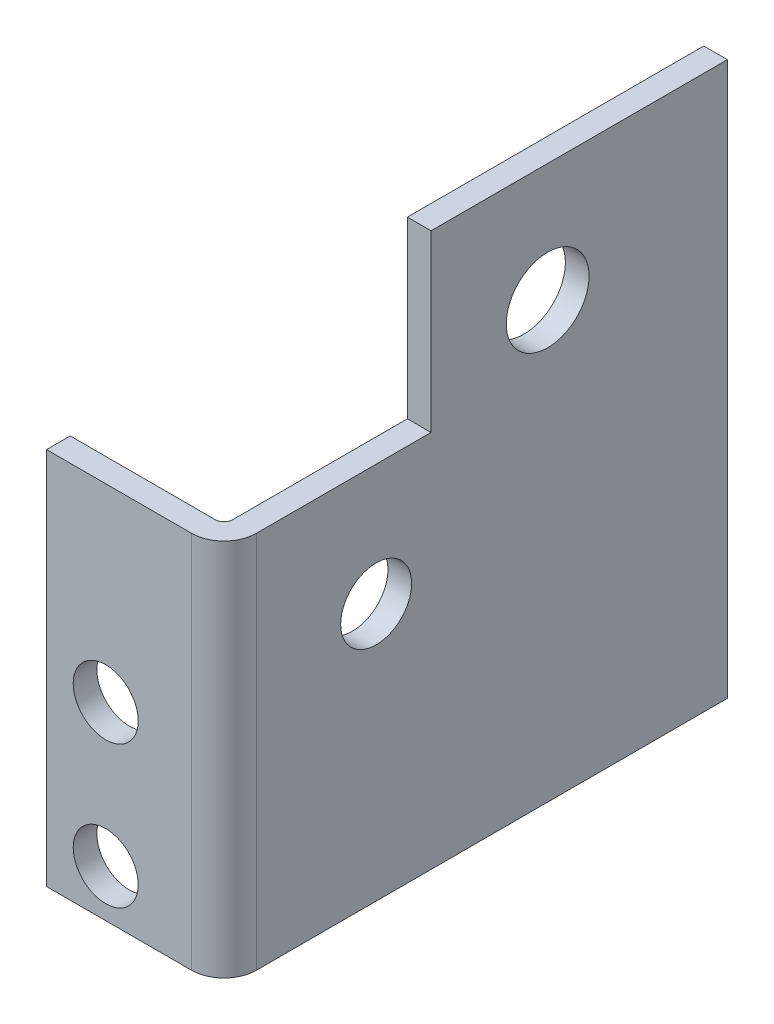
ISO-10303-21;
HEADER;
FILE_DESCRIPTION(('STEP AP214'),'2;1');
FILE_NAME('part.step','',(''),(''),'','','');
FILE_SCHEMA(('AUTOMOTIVE_DESIGN { 1 0 10303 214 1 1 1 1 }'));
ENDSEC;
DATA;
#1=APPLICATION_CONTEXT('core data for automotive mechanical design processes');
#2=APPLICATION_PROTOCOL_DEFINITION('international standard','automotive_design',2000,#1);
#3=PRODUCT_CONTEXT('',#1,'mechanical');
#4=PRODUCT('Part','Part','',(#3));
#5=PRODUCT_RELATED_PRODUCT_CATEGORY('part','',(#4));
#6=PRODUCT_DEFINITION_FORMATION('','',#4);
#7=PRODUCT_DEFINITION_CONTEXT('part definition',#1,'design');
#8=PRODUCT_DEFINITION('design','',#6,#7);
#9=PRODUCT_DEFINITION_SHAPE('','',#8);
#10=(LENGTH_UNIT() NAMED_UNIT(*) SI_UNIT(.MILLI.,.METRE.));
#11=(NAMED_UNIT(*) PLANE_ANGLE_UNIT() SI_UNIT($,.RADIAN.));
#12=(NAMED_UNIT(*) SI_UNIT($,.STERADIAN.) SOLID_ANGLE_UNIT());
#13=UNCERTAINTY_MEASURE_WITH_UNIT(LENGTH_MEASURE(1.E-05),#10,'distance_accuracy_value','');
#14=(GEOMETRIC_REPRESENTATION_CONTEXT(3) GLOBAL_UNCERTAINTY_ASSIGNED_CONTEXT((#13)) GLOBAL_UNIT_ASSIGNED_CONTEXT((#10,
#11,#12)) REPRESENTATION_CONTEXT('',''));
#15=CARTESIAN_POINT('',(0.,0.,0.));
#16=DIRECTION('',(0.,0.,1.));
#17=DIRECTION('',(1.,0.,0.));
#18=AXIS2_PLACEMENT_3D('',#15,#16,#17);
#19=CARTESIAN_POINT('',(2.,0.,-35.2));
#20=DIRECTION('',(-1.,0.,0.));
#21=DIRECTION('',(0.,0.,-1.));
#22=AXIS2_PLACEMENT_3D('',#19,#20,#21);
#23=PLANE('',#22);
#24=CARTESIAN_POINT('',(2.,25.,-5.4966));
#25=DIRECTION('',(-1.,0.,0.));
#26=DIRECTION('',(0.,0.,1.));
#27=AXIS2_PLACEMENT_3D('',#24,#25,#26);
#28=CIRCLE('',#27,3.);
#29=CARTESIAN_POINT('',(2.,25.,-2.4966));
#30=VERTEX_POINT('',#29);
#31=EDGE_CURVE('E140',#30,#30,#28,.T.);
#32=ORIENTED_EDGE('',*,*,#31,.T.);
#33=EDGE_LOOP('',(#32));
#34=FACE_BOUND('',#33,.T.);
#35=CARTESIAN_POINT('',(2.,40.,-20.));
#36=DIRECTION('',(1.,0.,0.));
#37=DIRECTION('',(0.,0.,-1.));
#38=AXIS2_PLACEMENT_3D('',#35,#36,#37);
#39=CIRCLE('',#38,3.5);
#40=CARTESIAN_POINT('',(2.,40.,-23.5));
#41=VERTEX_POINT('',#40);
#42=EDGE_CURVE('E198',#41,#41,#39,.T.);
#43=ORIENTED_EDGE('',*,*,#42,.F.);
#44=EDGE_LOOP('',(#43));
#45=FACE_BOUND('',#44,.T.);
#46=DIRECTION('',(0.,-1.,0.));
#47=VECTOR('',#46,1.);
#48=CARTESIAN_POINT('',(2.,3.23,4.6334));
#49=LINE('',#48,#47);
#50=CARTESIAN_POINT('',(2.,3.23,4.6334));
#51=VERTEX_POINT('',#50);
#52=CARTESIAN_POINT('',(2.,35.23,4.6334));
#53=VERTEX_POINT('',#52);
#54=EDGE_CURVE('E178',#51,#53,#49,.F.);
#55=ORIENTED_EDGE('',*,*,#54,.F.);
#56=DIRECTION('',(0.,0.,-1.));
#57=VECTOR('',#56,1.);
#58=CARTESIAN_POINT('',(2.,3.23,-35.2));
#59=LINE('',#58,#57);
#60=CARTESIAN_POINT('',(2.,3.23,-35.2));
#61=VERTEX_POINT('',#60);
#62=EDGE_CURVE('E206',#51,#61,#59,.T.);
#63=ORIENTED_EDGE('',*,*,#62,.T.);
#64=DIRECTION('',(0.,1.,0.));
#65=VECTOR('',#64,1.);
#66=CARTESIAN_POINT('',(2.,0.,-35.2));
#67=LINE('',#66,#65);
#68=CARTESIAN_POINT('',(2.,50.,-35.2));
#69=VERTEX_POINT('',#68);
#70=EDGE_CURVE('E209',#61,#69,#67,.T.);
#71=ORIENTED_EDGE('',*,*,#70,.T.);
#72=DIRECTION('',(0.,0.,1.));
#73=VECTOR('',#72,1.);
#74=CARTESIAN_POINT('',(2.,50.,-35.2));
#75=LINE('',#74,#73);
#76=CARTESIAN_POINT('',(2.,50.,-10.14));
#77=VERTEX_POINT('',#76);
#78=EDGE_CURVE('E11',#69,#77,#75,.T.);
#79=ORIENTED_EDGE('',*,*,#78,.T.);
#80=DIRECTION('',(0.,1.,0.));
#81=VECTOR('',#80,1.);
#82=CARTESIAN_POINT('',(2.,0.,-10.14));
#83=LINE('',#82,#81);
#84=CARTESIAN_POINT('',(2.,35.23,-10.14));
#85=VERTEX_POINT('',#84);
#86=EDGE_CURVE('E192',#85,#77,#83,.T.);
#87=ORIENTED_EDGE('',*,*,#86,.F.);
#88=DIRECTION('',(0.,0.,-1.));
#89=VECTOR('',#88,1.);
#90=CARTESIAN_POINT('',(2.,35.23,-15.1));
#91=LINE('',#90,#89);
#92=EDGE_CURVE('E149',#53,#85,#91,.T.);
#93=ORIENTED_EDGE('',*,*,#92,.F.);
#94=EDGE_LOOP('',(#55,#63,#71,#79,#87,#93));
#95=FACE_BOUND('',#94,.T.);
#96=ADVANCED_FACE('F37',(#34,#45,#95),#23,.F.);
#97=CARTESIAN_POINT('',(0.,0.,-35.2));
#98=DIRECTION('',(-1.,0.,0.));
#99=DIRECTION('',(0.,0.,-1.));
#100=AXIS2_PLACEMENT_3D('',#97,#98,#99);
#101=PLANE('',#100);
#102=CARTESIAN_POINT('',(0.,25.,-5.4966));
#103=DIRECTION('',(-1.,0.,0.));
#104=DIRECTION('',(0.,0.,1.));
#105=AXIS2_PLACEMENT_3D('',#102,#103,#104);
#106=CIRCLE('',#105,3.);
#107=CARTESIAN_POINT('',(0.,25.,-2.4966));
#108=VERTEX_POINT('',#107);
#109=EDGE_CURVE('E143',#108,#108,#106,.T.);
#110=ORIENTED_EDGE('',*,*,#109,.F.);
#111=EDGE_LOOP('',(#110));
#112=FACE_BOUND('',#111,.T.);
#113=CARTESIAN_POINT('',(0.,40.,-20.));
#114=DIRECTION('',(1.,0.,0.));
#115=DIRECTION('',(0.,0.,-1.));
#116=AXIS2_PLACEMENT_3D('',#113,#114,#115);
#117=CIRCLE('',#116,3.5);
#118=CARTESIAN_POINT('',(0.,40.,-23.5));
#119=VERTEX_POINT('',#118);
#120=EDGE_CURVE('E195',#119,#119,#117,.T.);
#121=ORIENTED_EDGE('',*,*,#120,.T.);
#122=EDGE_LOOP('',(#121));
#123=FACE_BOUND('',#122,.T.);
#124=DIRECTION('',(0.,-1.,0.));
#125=VECTOR('',#124,1.);
#126=CARTESIAN_POINT('',(0.,3.23,4.6334));
#127=LINE('',#126,#125);
#128=CARTESIAN_POINT('',(0.,3.23,4.6334));
#129=VERTEX_POINT('',#128);
#130=CARTESIAN_POINT('',(0.,35.23,4.6334));
#131=VERTEX_POINT('',#130);
#132=EDGE_CURVE('E183',#129,#131,#127,.F.);
#133=ORIENTED_EDGE('',*,*,#132,.T.);
#134=DIRECTION('',(0.,0.,1.));
#135=VECTOR('',#134,1.);
#136=CARTESIAN_POINT('',(0.,35.23,-15.1));
#137=LINE('',#136,#135);
#138=CARTESIAN_POINT('',(0.,35.23,-10.14));
#139=VERTEX_POINT('',#138);
#140=EDGE_CURVE('E139',#139,#131,#137,.T.);
#141=ORIENTED_EDGE('',*,*,#140,.F.);
#142=DIRECTION('',(0.,1.,0.));
#143=VECTOR('',#142,1.);
#144=CARTESIAN_POINT('',(0.,35.23,-10.14));
#145=LINE('',#144,#143);
#146=CARTESIAN_POINT('',(0.,50.,-10.14));
#147=VERTEX_POINT('',#146);
#148=EDGE_CURVE('E187',#139,#147,#145,.T.);
#149=ORIENTED_EDGE('',*,*,#148,.T.);
#150=DIRECTION('',(0.,0.,1.));
#151=VECTOR('',#150,1.);
#152=CARTESIAN_POINT('',(0.,50.,-35.2));
#153=LINE('',#152,#151);
#154=CARTESIAN_POINT('',(0.,50.,-35.2));
#155=VERTEX_POINT('',#154);
#156=EDGE_CURVE('E44',#155,#147,#153,.T.);
#157=ORIENTED_EDGE('',*,*,#156,.F.);
#158=DIRECTION('',(0.,1.,0.));
#159=VECTOR('',#158,1.);
#160=CARTESIAN_POINT('',(0.,0.,-35.2));
#161=LINE('',#160,#159);
#162=CARTESIAN_POINT('',(0.,3.23,-35.2));
#163=VERTEX_POINT('',#162);
#164=EDGE_CURVE('E214',#163,#155,#161,.T.);
#165=ORIENTED_EDGE('',*,*,#164,.F.);
#166=DIRECTION('',(0.,0.,1.));
#167=VECTOR('',#166,1.);
#168=CARTESIAN_POINT('',(0.,3.23,-35.2));
#169=LINE('',#168,#167);
#170=EDGE_CURVE('E201',#163,#129,#169,.T.);
#171=ORIENTED_EDGE('',*,*,#170,.T.);
#172=EDGE_LOOP('',(#133,#141,#149,#157,#165,#171));
#173=FACE_BOUND('',#172,.T.);
#174=ADVANCED_FACE('F223',(#112,#123,#173),#101,.T.);
#175=CARTESIAN_POINT('',(0.,3.23,0.));
#176=DIRECTION('',(0.,-1.,0.));
#177=DIRECTION('',(0.,0.,1.));
#178=AXIS2_PLACEMENT_3D('',#175,#176,#177);
#179=PLANE('',#178);
#180=ORIENTED_EDGE('',*,*,#170,.F.);
#181=DIRECTION('',(-1.,0.,0.));
#182=VECTOR('',#181,1.);
#183=CARTESIAN_POINT('',(0.,3.23,-35.2));
#184=LINE('',#183,#182);
#185=EDGE_CURVE('E204',#61,#163,#184,.T.);
#186=ORIENTED_EDGE('',*,*,#185,.F.);
#187=ORIENTED_EDGE('',*,*,#62,.F.);
#188=DIRECTION('',(1.,0.,0.));
#189=VECTOR('',#188,1.);
#190=CARTESIAN_POINT('',(0.,3.23,4.6334));
#191=LINE('',#190,#189);
#192=EDGE_CURVE('E180',#129,#51,#191,.T.);
#193=ORIENTED_EDGE('',*,*,#192,.F.);
#194=EDGE_LOOP('',(#180,#186,#187,#193));
#195=FACE_BOUND('',#194,.T.);
#196=ADVANCED_FACE('F237',(#195),#179,.T.);
#197=CARTESIAN_POINT('',(0.,0.,-35.2));
#198=DIRECTION('',(0.,0.,1.));
#199=DIRECTION('',(-1.,0.,0.));
#200=AXIS2_PLACEMENT_3D('',#197,#198,#199);
#201=PLANE('',#200);
#202=ORIENTED_EDGE('',*,*,#185,.T.);
#203=ORIENTED_EDGE('',*,*,#164,.T.);
#204=DIRECTION('',(1.,0.,0.));
#205=VECTOR('',#204,1.);
#206=CARTESIAN_POINT('',(0.,50.,-35.2));
#207=LINE('',#206,#205);
#208=EDGE_CURVE('E212',#155,#69,#207,.T.);
#209=ORIENTED_EDGE('',*,*,#208,.T.);
#210=ORIENTED_EDGE('',*,*,#70,.F.);
#211=EDGE_LOOP('',(#202,#203,#209,#210));
#212=FACE_BOUND('',#211,.T.);
#213=ADVANCED_FACE('F234',(#212),#201,.F.);
#214=CARTESIAN_POINT('',(0.,50.,-35.2));
#215=DIRECTION('',(0.,1.,0.));
#216=DIRECTION('',(0.,0.,-1.));
#217=AXIS2_PLACEMENT_3D('',#214,#215,#216);
#218=PLANE('',#217);
#219=DIRECTION('',(-1.,0.,0.));
#220=VECTOR('',#219,1.);
#221=CARTESIAN_POINT('',(8.,50.,-10.14));
#222=LINE('',#221,#220);
#223=EDGE_CURVE('E190',#77,#147,#222,.T.);
#224=ORIENTED_EDGE('',*,*,#223,.F.);
#225=ORIENTED_EDGE('',*,*,#78,.F.);
#226=ORIENTED_EDGE('',*,*,#208,.F.);
#227=ORIENTED_EDGE('',*,*,#156,.T.);
#228=EDGE_LOOP('',(#224,#225,#226,#227));
#229=FACE_BOUND('',#228,.T.);
#230=ADVANCED_FACE('F219',(#229),#218,.T.);
#231=CARTESIAN_POINT('',(10.,40.,-20.));
#232=DIRECTION('',(-1.,0.,0.));
#233=DIRECTION('',(0.,0.,-1.));
#234=AXIS2_PLACEMENT_3D('',#231,#232,#233);
#235=CYLINDRICAL_SURFACE('',#234,3.5);
#236=ORIENTED_EDGE('',*,*,#120,.F.);
#237=EDGE_LOOP('',(#236));
#238=FACE_BOUND('',#237,.T.);
#239=ORIENTED_EDGE('',*,*,#42,.T.);
#240=EDGE_LOOP('',(#239));
#241=FACE_BOUND('',#240,.T.);
#242=ADVANCED_FACE('F264',(#238,#241),#235,.F.);
#243=CARTESIAN_POINT('',(8.,35.23,-10.14));
#244=DIRECTION('',(0.,0.,-1.));
#245=DIRECTION('',(1.,0.,0.));
#246=AXIS2_PLACEMENT_3D('',#243,#244,#245);
#247=PLANE('',#246);
#248=DIRECTION('',(-1.,0.,0.));
#249=VECTOR('',#248,1.);
#250=CARTESIAN_POINT('',(8.,35.23,-10.14));
#251=LINE('',#250,#249);
#252=EDGE_CURVE('E59',#85,#139,#251,.T.);
#253=ORIENTED_EDGE('',*,*,#252,.F.);
#254=ORIENTED_EDGE('',*,*,#86,.T.);
#255=ORIENTED_EDGE('',*,*,#223,.T.);
#256=ORIENTED_EDGE('',*,*,#148,.F.);
#257=EDGE_LOOP('',(#253,#254,#255,#256));
#258=FACE_BOUND('',#257,.T.);
#259=ADVANCED_FACE('F224',(#258),#247,.F.);
#260=CARTESIAN_POINT('',(-0.736599999999997,3.23,4.6334));
#261=DIRECTION('',(0.,1.,0.));
#262=DIRECTION('',(0.,0.,-1.));
#263=AXIS2_PLACEMENT_3D('',#260,#261,#262);
#264=PLANE('',#263);
#265=CARTESIAN_POINT('',(-0.736599999999997,3.23,4.6334));
#266=DIRECTION('',(0.,1.,0.));
#267=DIRECTION('',(0.,0.,1.));
#268=AXIS2_PLACEMENT_3D('',#265,#266,#267);
#269=CIRCLE('',#268,0.7366);
#270=CARTESIAN_POINT('',(-0.736599999999994,3.23,5.37));
#271=VERTEX_POINT('',#270);
#272=EDGE_CURVE('E51',#271,#129,#269,.T.);
#273=ORIENTED_EDGE('',*,*,#272,.T.);
#274=ORIENTED_EDGE('',*,*,#192,.T.);
#275=CARTESIAN_POINT('',(-0.736599999999997,3.23,4.6334));
#276=DIRECTION('',(0.,1.,0.));
#277=DIRECTION('',(0.,0.,1.));
#278=AXIS2_PLACEMENT_3D('',#275,#276,#277);
#279=CIRCLE('',#278,2.7366);
#280=CARTESIAN_POINT('',(-0.736599999999997,3.23,7.37));
#281=VERTEX_POINT('',#280);
#282=EDGE_CURVE('E181',#281,#51,#279,.T.);
#283=ORIENTED_EDGE('',*,*,#282,.F.);
#284=DIRECTION('',(0.,0.,1.));
#285=VECTOR('',#284,1.);
#286=CARTESIAN_POINT('',(-0.736599999999997,3.23,5.37));
#287=LINE('',#286,#285);
#288=EDGE_CURVE('E125',#271,#281,#287,.T.);
#289=ORIENTED_EDGE('',*,*,#288,.F.);
#290=EDGE_LOOP('',(#273,#274,#283,#289));
#291=FACE_BOUND('',#290,.T.);
#292=ADVANCED_FACE('F239',(#291),#264,.F.);
#293=CARTESIAN_POINT('',(-0.736599999999997,3.23,4.6334));
#294=DIRECTION('',(0.,-1.,0.));
#295=DIRECTION('',(0.,0.,1.));
#296=AXIS2_PLACEMENT_3D('',#293,#294,#295);
#297=CYLINDRICAL_SURFACE('',#296,2.7366);
#298=ORIENTED_EDGE('',*,*,#54,.T.);
#299=CARTESIAN_POINT('',(-0.736599999999997,35.23,4.6334));
#300=DIRECTION('',(0.,1.,0.));
#301=DIRECTION('',(0.,0.,1.));
#302=AXIS2_PLACEMENT_3D('',#299,#300,#301);
#303=CIRCLE('',#302,2.7366);
#304=CARTESIAN_POINT('',(-0.736599999999997,35.23,7.37));
#305=VERTEX_POINT('',#304);
#306=EDGE_CURVE('E152',#305,#53,#303,.T.);
#307=ORIENTED_EDGE('',*,*,#306,.F.);
#308=DIRECTION('',(0.,-1.,0.));
#309=VECTOR('',#308,1.);
#310=CARTESIAN_POINT('',(-0.736599999999997,0.,7.37));
#311=LINE('',#310,#309);
#312=EDGE_CURVE('E173',#305,#281,#311,.T.);
#313=ORIENTED_EDGE('',*,*,#312,.T.);
#314=ORIENTED_EDGE('',*,*,#282,.T.);
#315=EDGE_LOOP('',(#298,#307,#313,#314));
#316=FACE_BOUND('',#315,.T.);
#317=ADVANCED_FACE('F241',(#316),#297,.T.);
#318=CARTESIAN_POINT('',(-0.736599999999997,3.23,4.6334));
#319=DIRECTION('',(0.,-1.,0.));
#320=DIRECTION('',(0.,0.,1.));
#321=AXIS2_PLACEMENT_3D('',#318,#319,#320);
#322=CYLINDRICAL_SURFACE('',#321,0.7366);
#323=ORIENTED_EDGE('',*,*,#132,.F.);
#324=ORIENTED_EDGE('',*,*,#272,.F.);
#325=DIRECTION('',(0.,1.,0.));
#326=VECTOR('',#325,1.);
#327=CARTESIAN_POINT('',(-0.736599999999997,23.23,5.37));
#328=LINE('',#327,#326);
#329=CARTESIAN_POINT('',(-0.736599999999997,35.23,5.37000000000004));
#330=VERTEX_POINT('',#329);
#331=EDGE_CURVE('E116',#330,#271,#328,.F.);
#332=ORIENTED_EDGE('',*,*,#331,.F.);
#333=CARTESIAN_POINT('',(-0.736599999999997,35.23,4.6334));
#334=DIRECTION('',(0.,1.,0.));
#335=DIRECTION('',(0.,0.,1.));
#336=AXIS2_PLACEMENT_3D('',#333,#334,#335);
#337=CIRCLE('',#336,0.73660000000002);
#338=EDGE_CURVE('E121',#131,#330,#337,.F.);
#339=ORIENTED_EDGE('',*,*,#338,.F.);
#340=EDGE_LOOP('',(#323,#324,#332,#339));
#341=FACE_BOUND('',#340,.T.);
#342=ADVANCED_FACE('F119',(#341),#322,.F.);
#343=CARTESIAN_POINT('',(0.,3.23,7.37));
#344=DIRECTION('',(0.,-1.,0.));
#345=DIRECTION('',(0.,0.,1.));
#346=AXIS2_PLACEMENT_3D('',#343,#344,#345);
#347=PLANE('',#346);
#348=DIRECTION('',(1.,0.,0.));
#349=VECTOR('',#348,1.);
#350=CARTESIAN_POINT('',(0.,3.23,7.37));
#351=LINE('',#350,#349);
#352=CARTESIAN_POINT('',(-13.,3.23,7.37000000000004));
#353=VERTEX_POINT('',#352);
#354=EDGE_CURVE('E166',#353,#281,#351,.T.);
#355=ORIENTED_EDGE('',*,*,#354,.F.);
#356=DIRECTION('',(0.,0.,-1.));
#357=VECTOR('',#356,1.);
#358=CARTESIAN_POINT('',(-13.,3.23,7.37000000000004));
#359=LINE('',#358,#357);
#360=CARTESIAN_POINT('',(-13.,3.23,5.37000000000004));
#361=VERTEX_POINT('',#360);
#362=EDGE_CURVE('E163',#353,#361,#359,.T.);
#363=ORIENTED_EDGE('',*,*,#362,.T.);
#364=DIRECTION('',(-1.,0.,0.));
#365=VECTOR('',#364,1.);
#366=CARTESIAN_POINT('',(0.,3.23,5.37));
#367=LINE('',#366,#365);
#368=EDGE_CURVE('E170',#361,#271,#367,.F.);
#369=ORIENTED_EDGE('',*,*,#368,.T.);
#370=ORIENTED_EDGE('',*,*,#288,.T.);
#371=EDGE_LOOP('',(#355,#363,#369,#370));
#372=FACE_BOUND('',#371,.T.);
#373=ADVANCED_FACE('F246',(#372),#347,.T.);
#374=CARTESIAN_POINT('',(0.,0.,7.37));
#375=DIRECTION('',(0.,0.,1.));
#376=DIRECTION('',(-1.,0.,0.));
#377=AXIS2_PLACEMENT_3D('',#374,#375,#376);
#378=PLANE('',#377);
#379=CARTESIAN_POINT('',(-8.00000000000001,7.23,7.37000000000003));
#380=DIRECTION('',(0.,0.,-1.));
#381=DIRECTION('',(-1.,0.,0.));
#382=AXIS2_PLACEMENT_3D('',#379,#380,#381);
#383=CIRCLE('',#382,2.75);
#384=CARTESIAN_POINT('',(-10.75,7.23,7.37000000000004));
#385=VERTEX_POINT('',#384);
#386=EDGE_CURVE('E155',#385,#385,#383,.T.);
#387=ORIENTED_EDGE('',*,*,#386,.T.);
#388=EDGE_LOOP('',(#387));
#389=FACE_BOUND('',#388,.T.);
#390=CARTESIAN_POINT('',(-8.00000000000001,19.23,7.37000000000003));
#391=DIRECTION('',(0.,0.,-1.));
#392=DIRECTION('',(-1.,0.,0.));
#393=AXIS2_PLACEMENT_3D('',#390,#391,#392);
#394=CIRCLE('',#393,2.75);
#395=CARTESIAN_POINT('',(-10.75,19.23,7.37000000000004));
#396=VERTEX_POINT('',#395);
#397=EDGE_CURVE('E126',#396,#396,#394,.T.);
#398=ORIENTED_EDGE('',*,*,#397,.T.);
#399=EDGE_LOOP('',(#398));
#400=FACE_BOUND('',#399,.T.);
#401=ORIENTED_EDGE('',*,*,#312,.F.);
#402=DIRECTION('',(1.,0.,0.));
#403=VECTOR('',#402,1.);
#404=CARTESIAN_POINT('',(-13.,35.23,7.37));
#405=LINE('',#404,#403);
#406=CARTESIAN_POINT('',(-13.,35.23,7.37));
#407=VERTEX_POINT('',#406);
#408=EDGE_CURVE('E250',#407,#305,#405,.T.);
#409=ORIENTED_EDGE('',*,*,#408,.F.);
#410=DIRECTION('',(0.,-1.,0.));
#411=VECTOR('',#410,1.);
#412=CARTESIAN_POINT('',(-13.,3.23,7.37000000000004));
#413=LINE('',#412,#411);
#414=EDGE_CURVE('E168',#407,#353,#413,.T.);
#415=ORIENTED_EDGE('',*,*,#414,.T.);
#416=ORIENTED_EDGE('',*,*,#354,.T.);
#417=EDGE_LOOP('',(#401,#409,#415,#416));
#418=FACE_BOUND('',#417,.T.);
#419=ADVANCED_FACE('F291',(#389,#400,#418),#378,.T.);
#420=CARTESIAN_POINT('',(0.,0.,5.37));
#421=DIRECTION('',(0.,0.,1.));
#422=DIRECTION('',(-1.,0.,0.));
#423=AXIS2_PLACEMENT_3D('',#420,#421,#422);
#424=PLANE('',#423);
#425=CARTESIAN_POINT('',(-8.00000000000001,7.23,5.37));
#426=DIRECTION('',(0.,0.,1.));
#427=DIRECTION('',(1.,0.,0.));
#428=AXIS2_PLACEMENT_3D('',#425,#426,#427);
#429=CIRCLE('',#428,2.75);
#430=CARTESIAN_POINT('',(-5.25000000000001,7.23,5.37));
#431=VERTEX_POINT('',#430);
#432=EDGE_CURVE('E148',#431,#431,#429,.T.);
#433=ORIENTED_EDGE('',*,*,#432,.T.);
#434=EDGE_LOOP('',(#433));
#435=FACE_BOUND('',#434,.T.);
#436=CARTESIAN_POINT('',(-8.00000000000001,19.23,5.37));
#437=DIRECTION('',(0.,0.,1.));
#438=DIRECTION('',(1.,0.,0.));
#439=AXIS2_PLACEMENT_3D('',#436,#437,#438);
#440=CIRCLE('',#439,2.75);
#441=CARTESIAN_POINT('',(-5.25000000000001,19.23,5.37));
#442=VERTEX_POINT('',#441);
#443=EDGE_CURVE('E158',#442,#442,#440,.T.);
#444=ORIENTED_EDGE('',*,*,#443,.T.);
#445=EDGE_LOOP('',(#444));
#446=FACE_BOUND('',#445,.T.);
#447=ORIENTED_EDGE('',*,*,#331,.T.);
#448=ORIENTED_EDGE('',*,*,#368,.F.);
#449=DIRECTION('',(0.,1.,0.));
#450=VECTOR('',#449,1.);
#451=CARTESIAN_POINT('',(-13.,0.,5.37000000000004));
#452=LINE('',#451,#450);
#453=CARTESIAN_POINT('',(-13.,35.23,5.37000000000004));
#454=VERTEX_POINT('',#453);
#455=EDGE_CURVE('E131',#454,#361,#452,.F.);
#456=ORIENTED_EDGE('',*,*,#455,.F.);
#457=DIRECTION('',(-1.,0.,0.));
#458=VECTOR('',#457,1.);
#459=CARTESIAN_POINT('',(-13.,35.23,5.37000000000004));
#460=LINE('',#459,#458);
#461=EDGE_CURVE('E129',#330,#454,#460,.T.);
#462=ORIENTED_EDGE('',*,*,#461,.F.);
#463=EDGE_LOOP('',(#447,#448,#456,#462));
#464=FACE_BOUND('',#463,.T.);
#465=ADVANCED_FACE('F130',(#435,#446,#464),#424,.F.);
#466=CARTESIAN_POINT('',(-13.,3.23,7.37000000000004));
#467=DIRECTION('',(-1.,0.,0.));
#468=DIRECTION('',(0.,0.,-1.));
#469=AXIS2_PLACEMENT_3D('',#466,#467,#468);
#470=PLANE('',#469);
#471=ORIENTED_EDGE('',*,*,#455,.T.);
#472=ORIENTED_EDGE('',*,*,#362,.F.);
#473=ORIENTED_EDGE('',*,*,#414,.F.);
#474=DIRECTION('',(0.,0.,1.));
#475=VECTOR('',#474,1.);
#476=CARTESIAN_POINT('',(-13.,35.23,5.37000000000004));
#477=LINE('',#476,#475);
#478=EDGE_CURVE('E135',#454,#407,#477,.T.);
#479=ORIENTED_EDGE('',*,*,#478,.F.);
#480=EDGE_LOOP('',(#471,#472,#473,#479));
#481=FACE_BOUND('',#480,.T.);
#482=ADVANCED_FACE('F249',(#481),#470,.T.);
#483=CARTESIAN_POINT('',(-8.00000000000001,19.23,14.88));
#484=DIRECTION('',(0.,0.,-1.));
#485=DIRECTION('',(1.,0.,0.));
#486=AXIS2_PLACEMENT_3D('',#483,#484,#485);
#487=CYLINDRICAL_SURFACE('',#486,2.75);
#488=ORIENTED_EDGE('',*,*,#397,.F.);
#489=EDGE_LOOP('',(#488));
#490=FACE_BOUND('',#489,.T.);
#491=ORIENTED_EDGE('',*,*,#443,.F.);
#492=EDGE_LOOP('',(#491));
#493=FACE_BOUND('',#492,.T.);
#494=ADVANCED_FACE('F286',(#490,#493),#487,.F.);
#495=CARTESIAN_POINT('',(-8.00000000000001,7.23,14.88));
#496=DIRECTION('',(0.,0.,-1.));
#497=DIRECTION('',(1.,0.,0.));
#498=AXIS2_PLACEMENT_3D('',#495,#496,#497);
#499=CYLINDRICAL_SURFACE('',#498,2.75);
#500=ORIENTED_EDGE('',*,*,#386,.F.);
#501=EDGE_LOOP('',(#500));
#502=FACE_BOUND('',#501,.T.);
#503=ORIENTED_EDGE('',*,*,#432,.F.);
#504=EDGE_LOOP('',(#503));
#505=FACE_BOUND('',#504,.T.);
#506=ADVANCED_FACE('F281',(#502,#505),#499,.F.);
#507=CARTESIAN_POINT('',(10.,35.23,-15.1));
#508=DIRECTION('',(0.,1.,0.));
#509=DIRECTION('',(0.,0.,-1.));
#510=AXIS2_PLACEMENT_3D('',#507,#508,#509);
#511=PLANE('',#510);
#512=ORIENTED_EDGE('',*,*,#252,.T.);
#513=ORIENTED_EDGE('',*,*,#140,.T.);
#514=ORIENTED_EDGE('',*,*,#338,.T.);
#515=ORIENTED_EDGE('',*,*,#461,.T.);
#516=ORIENTED_EDGE('',*,*,#478,.T.);
#517=ORIENTED_EDGE('',*,*,#408,.T.);
#518=ORIENTED_EDGE('',*,*,#306,.T.);
#519=ORIENTED_EDGE('',*,*,#92,.T.);
#520=EDGE_LOOP('',(#512,#513,#514,#515,#516,#517,#518,#519));
#521=FACE_BOUND('',#520,.T.);
#522=ADVANCED_FACE('F137',(#521),#511,.T.);
#523=CARTESIAN_POINT('',(2.,25.,-5.4966));
#524=DIRECTION('',(-1.,0.,0.));
#525=DIRECTION('',(0.,0.,1.));
#526=AXIS2_PLACEMENT_3D('',#523,#524,#525);
#527=CYLINDRICAL_SURFACE('',#526,3.);
#528=ORIENTED_EDGE('',*,*,#31,.F.);
#529=EDGE_LOOP('',(#528));
#530=FACE_BOUND('',#529,.T.);
#531=ORIENTED_EDGE('',*,*,#109,.T.);
#532=EDGE_LOOP('',(#531));
#533=FACE_BOUND('',#532,.T.);
#534=ADVANCED_FACE('F257',(#530,#533),#527,.F.);
#535=CLOSED_SHELL('',(#96,#174,#196,#213,#230,#242,#259,#292,#317,#342,#373,#419,#465,#482,#494,
#506,#522,#534));
#536=MANIFOLD_SOLID_BREP('B2',#535);
#537=ADVANCED_BREP_SHAPE_REPRESENTATION('',(#18,#536),#14);
#538=SHAPE_DEFINITION_REPRESENTATION(#9,#537);
ENDSEC;
END-ISO-10303-21;
